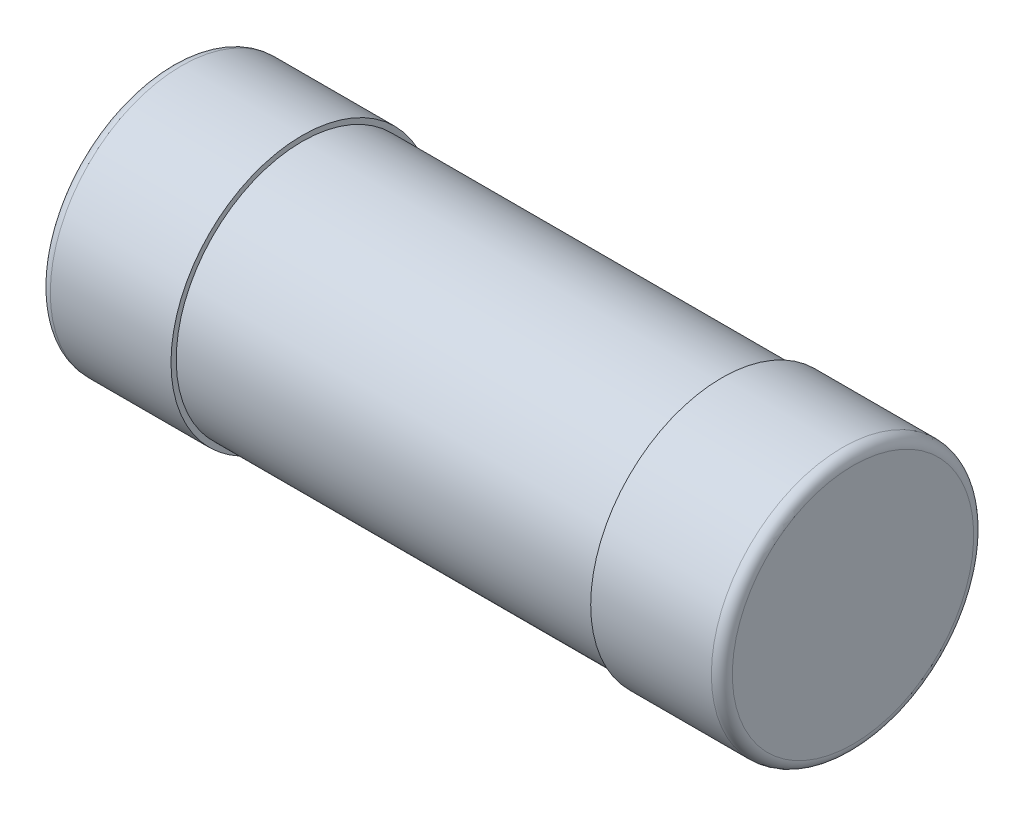
ISO-10303-21;
HEADER;
FILE_DESCRIPTION(('STEP AP214'),'2;1');
FILE_NAME('part.step','',(''),(''),'','','');
FILE_SCHEMA(('AUTOMOTIVE_DESIGN { 1 0 10303 214 1 1 1 1 }'));
ENDSEC;
DATA;
#1=APPLICATION_CONTEXT('core data for automotive mechanical design processes');
#2=APPLICATION_PROTOCOL_DEFINITION('international standard','automotive_design',2000,#1);
#3=PRODUCT_CONTEXT('',#1,'mechanical');
#4=PRODUCT('Part','Part','',(#3));
#5=PRODUCT_RELATED_PRODUCT_CATEGORY('part','',(#4));
#6=PRODUCT_DEFINITION_FORMATION('','',#4);
#7=PRODUCT_DEFINITION_CONTEXT('part definition',#1,'design');
#8=PRODUCT_DEFINITION('design','',#6,#7);
#9=PRODUCT_DEFINITION_SHAPE('','',#8);
#10=(LENGTH_UNIT() NAMED_UNIT(*) SI_UNIT(.MILLI.,.METRE.));
#11=(NAMED_UNIT(*) PLANE_ANGLE_UNIT() SI_UNIT($,.RADIAN.));
#12=(NAMED_UNIT(*) SI_UNIT($,.STERADIAN.) SOLID_ANGLE_UNIT());
#13=UNCERTAINTY_MEASURE_WITH_UNIT(LENGTH_MEASURE(1.E-05),#10,'distance_accuracy_value','');
#14=(GEOMETRIC_REPRESENTATION_CONTEXT(3) GLOBAL_UNCERTAINTY_ASSIGNED_CONTEXT((#13)) GLOBAL_UNIT_ASSIGNED_CONTEXT((#10,
#11,#12)) REPRESENTATION_CONTEXT('',''));
#15=CARTESIAN_POINT('',(0.,0.,0.));
#16=DIRECTION('',(0.,0.,1.));
#17=DIRECTION('',(1.,0.,0.));
#18=AXIS2_PLACEMENT_3D('',#15,#16,#17);
#19=CARTESIAN_POINT('',(3.25,0.,1.25));
#20=DIRECTION('',(1.,0.,0.));
#21=DIRECTION('',(0.,-1.,0.));
#22=AXIS2_PLACEMENT_3D('',#19,#20,#21);
#23=PLANE('',#22);
#24=CARTESIAN_POINT('',(3.25,0.,1.25));
#25=DIRECTION('',(1.,0.,0.));
#26=DIRECTION('',(0.,1.,0.));
#27=AXIS2_PLACEMENT_3D('',#24,#25,#26);
#28=CIRCLE('',#27,1.15);
#29=CARTESIAN_POINT('',(3.25,1.15,1.25));
#30=VERTEX_POINT('',#29);
#31=EDGE_CURVE('E10',#30,#30,#28,.T.);
#32=ORIENTED_EDGE('',*,*,#31,.T.);
#33=EDGE_LOOP('',(#32));
#34=FACE_BOUND('',#33,.T.);
#35=ADVANCED_FACE('F16',(#34),#23,.T.);
#36=CARTESIAN_POINT('',(3.15,0.,1.25));
#37=DIRECTION('',(1.,0.,0.));
#38=DIRECTION('',(0.,1.,0.));
#39=AXIS2_PLACEMENT_3D('',#36,#37,#38);
#40=TOROIDAL_SURFACE('',#39,1.15,0.1);
#41=CARTESIAN_POINT('',(3.15,1.15,1.25));
#42=DIRECTION('',(0.,0.,-1.));
#43=DIRECTION('',(0.,1.,0.));
#44=AXIS2_PLACEMENT_3D('',#41,#42,#43);
#45=CIRCLE('',#44,0.1);
#46=CARTESIAN_POINT('',(3.15,1.25,1.25));
#47=VERTEX_POINT('',#46);
#48=EDGE_CURVE('E26',#47,#30,#45,.T.);
#49=ORIENTED_EDGE('',*,*,#48,.F.);
#50=CARTESIAN_POINT('',(3.15,0.,1.25));
#51=DIRECTION('',(1.,0.,0.));
#52=DIRECTION('',(0.,1.,0.));
#53=AXIS2_PLACEMENT_3D('',#50,#51,#52);
#54=CIRCLE('',#53,1.25);
#55=EDGE_CURVE('E103',#47,#47,#54,.T.);
#56=ORIENTED_EDGE('',*,*,#55,.T.);
#57=ORIENTED_EDGE('',*,*,#48,.T.);
#58=ORIENTED_EDGE('',*,*,#31,.F.);
#59=EDGE_LOOP('',(#49,#56,#57,#58));
#60=FACE_BOUND('',#59,.T.);
#61=ADVANCED_FACE('F127',(#60),#40,.T.);
#62=CARTESIAN_POINT('',(2.,0.,1.25));
#63=DIRECTION('',(-1.,0.,0.));
#64=DIRECTION('',(0.,1.,0.));
#65=AXIS2_PLACEMENT_3D('',#62,#63,#64);
#66=CYLINDRICAL_SURFACE('',#65,1.25);
#67=CARTESIAN_POINT('',(2.,0.,1.25));
#68=DIRECTION('',(1.,0.,0.));
#69=DIRECTION('',(0.,1.,0.));
#70=AXIS2_PLACEMENT_3D('',#67,#68,#69);
#71=CIRCLE('',#70,1.25);
#72=CARTESIAN_POINT('',(2.,1.25,1.25));
#73=VERTEX_POINT('',#72);
#74=EDGE_CURVE('E85',#73,#73,#71,.T.);
#75=ORIENTED_EDGE('',*,*,#74,.T.);
#76=DIRECTION('',(1.,0.,0.));
#77=VECTOR('',#76,1.);
#78=CARTESIAN_POINT('',(2.,1.25,1.25));
#79=LINE('',#78,#77);
#80=EDGE_CURVE('E89',#73,#47,#79,.T.);
#81=ORIENTED_EDGE('',*,*,#80,.T.);
#82=ORIENTED_EDGE('',*,*,#55,.F.);
#83=ORIENTED_EDGE('',*,*,#80,.F.);
#84=EDGE_LOOP('',(#75,#81,#82,#83));
#85=FACE_BOUND('',#84,.T.);
#86=ADVANCED_FACE('F121',(#85),#66,.T.);
#87=CARTESIAN_POINT('',(2.,0.,1.25));
#88=DIRECTION('',(1.,0.,0.));
#89=DIRECTION('',(0.,-1.,0.));
#90=AXIS2_PLACEMENT_3D('',#87,#88,#89);
#91=PLANE('',#90);
#92=CARTESIAN_POINT('',(2.,0.,1.25));
#93=DIRECTION('',(1.,0.,0.));
#94=DIRECTION('',(0.,1.,0.));
#95=AXIS2_PLACEMENT_3D('',#92,#93,#94);
#96=CIRCLE('',#95,1.2);
#97=CARTESIAN_POINT('',(2.,1.2,1.25));
#98=VERTEX_POINT('',#97);
#99=EDGE_CURVE('E96',#98,#98,#96,.T.);
#100=ORIENTED_EDGE('',*,*,#99,.T.);
#101=EDGE_LOOP('',(#100));
#102=FACE_BOUND('',#101,.T.);
#103=ORIENTED_EDGE('',*,*,#74,.F.);
#104=EDGE_LOOP('',(#103));
#105=FACE_BOUND('',#104,.T.);
#106=ADVANCED_FACE('F118',(#102,#105),#91,.F.);
#107=CARTESIAN_POINT('',(-2.,0.,1.25));
#108=DIRECTION('',(-1.,0.,0.));
#109=DIRECTION('',(0.,1.,0.));
#110=AXIS2_PLACEMENT_3D('',#107,#108,#109);
#111=CYLINDRICAL_SURFACE('',#110,1.2);
#112=ORIENTED_EDGE('',*,*,#99,.F.);
#113=DIRECTION('',(1.,0.,0.));
#114=VECTOR('',#113,1.);
#115=CARTESIAN_POINT('',(-2.,1.2,1.25));
#116=LINE('',#115,#114);
#117=CARTESIAN_POINT('',(-2.,1.2,1.25));
#118=VERTEX_POINT('',#117);
#119=EDGE_CURVE('E90',#118,#98,#116,.T.);
#120=ORIENTED_EDGE('',*,*,#119,.F.);
#121=CARTESIAN_POINT('',(-2.,0.,1.25));
#122=DIRECTION('',(1.,0.,0.));
#123=DIRECTION('',(0.,1.,0.));
#124=AXIS2_PLACEMENT_3D('',#121,#122,#123);
#125=CIRCLE('',#124,1.2);
#126=EDGE_CURVE('E82',#118,#118,#125,.T.);
#127=ORIENTED_EDGE('',*,*,#126,.T.);
#128=ORIENTED_EDGE('',*,*,#119,.T.);
#129=EDGE_LOOP('',(#112,#120,#127,#128));
#130=FACE_BOUND('',#129,.T.);
#131=ADVANCED_FACE('F115',(#130),#111,.T.);
#132=CARTESIAN_POINT('',(-3.25,0.,1.25));
#133=DIRECTION('',(-1.,0.,0.));
#134=DIRECTION('',(0.,0.,1.));
#135=AXIS2_PLACEMENT_3D('',#132,#133,#134);
#136=PLANE('',#135);
#137=CARTESIAN_POINT('',(-3.25,0.,1.25));
#138=DIRECTION('',(-1.,0.,0.));
#139=DIRECTION('',(0.,1.,0.));
#140=AXIS2_PLACEMENT_3D('',#137,#138,#139);
#141=CIRCLE('',#140,1.15);
#142=CARTESIAN_POINT('',(-3.25,1.15,1.25));
#143=VERTEX_POINT('',#142);
#144=EDGE_CURVE('E74',#143,#143,#141,.T.);
#145=ORIENTED_EDGE('',*,*,#144,.T.);
#146=EDGE_LOOP('',(#145));
#147=FACE_BOUND('',#146,.T.);
#148=ADVANCED_FACE('F137',(#147),#136,.T.);
#149=CARTESIAN_POINT('',(-2.,0.,1.25));
#150=DIRECTION('',(-1.,0.,0.));
#151=DIRECTION('',(0.,0.,1.));
#152=AXIS2_PLACEMENT_3D('',#149,#150,#151);
#153=PLANE('',#152);
#154=ORIENTED_EDGE('',*,*,#126,.F.);
#155=EDGE_LOOP('',(#154));
#156=FACE_BOUND('',#155,.T.);
#157=CARTESIAN_POINT('',(-2.,0.,1.25));
#158=DIRECTION('',(-1.,0.,0.));
#159=DIRECTION('',(0.,1.,0.));
#160=AXIS2_PLACEMENT_3D('',#157,#158,#159);
#161=CIRCLE('',#160,1.25);
#162=CARTESIAN_POINT('',(-2.,1.25,1.25));
#163=VERTEX_POINT('',#162);
#164=EDGE_CURVE('E19',#163,#163,#161,.T.);
#165=ORIENTED_EDGE('',*,*,#164,.F.);
#166=EDGE_LOOP('',(#165));
#167=FACE_BOUND('',#166,.T.);
#168=ADVANCED_FACE('F141',(#156,#167),#153,.F.);
#169=CARTESIAN_POINT('',(-3.15,0.,1.25));
#170=DIRECTION('',(-1.,0.,0.));
#171=DIRECTION('',(0.,1.,0.));
#172=AXIS2_PLACEMENT_3D('',#169,#170,#171);
#173=TOROIDAL_SURFACE('',#172,1.15,0.1);
#174=CARTESIAN_POINT('',(-3.15,1.15,1.25));
#175=DIRECTION('',(0.,0.,1.));
#176=DIRECTION('',(0.,1.,0.));
#177=AXIS2_PLACEMENT_3D('',#174,#175,#176);
#178=CIRCLE('',#177,0.1);
#179=CARTESIAN_POINT('',(-3.15,1.25,1.25));
#180=VERTEX_POINT('',#179);
#181=EDGE_CURVE('E71',#180,#143,#178,.T.);
#182=ORIENTED_EDGE('',*,*,#181,.F.);
#183=CARTESIAN_POINT('',(-3.15,0.,1.25));
#184=DIRECTION('',(-1.,0.,0.));
#185=DIRECTION('',(0.,1.,0.));
#186=AXIS2_PLACEMENT_3D('',#183,#184,#185);
#187=CIRCLE('',#186,1.25);
#188=EDGE_CURVE('E73',#180,#180,#187,.T.);
#189=ORIENTED_EDGE('',*,*,#188,.T.);
#190=ORIENTED_EDGE('',*,*,#181,.T.);
#191=ORIENTED_EDGE('',*,*,#144,.F.);
#192=EDGE_LOOP('',(#182,#189,#190,#191));
#193=FACE_BOUND('',#192,.T.);
#194=ADVANCED_FACE('F72',(#193),#173,.T.);
#195=CARTESIAN_POINT('',(-2.,0.,1.25));
#196=DIRECTION('',(1.,0.,0.));
#197=DIRECTION('',(0.,1.,0.));
#198=AXIS2_PLACEMENT_3D('',#195,#196,#197);
#199=CYLINDRICAL_SURFACE('',#198,1.25);
#200=ORIENTED_EDGE('',*,*,#164,.T.);
#201=DIRECTION('',(-1.,0.,0.));
#202=VECTOR('',#201,1.);
#203=CARTESIAN_POINT('',(-2.,1.25,1.25));
#204=LINE('',#203,#202);
#205=EDGE_CURVE('E63',#163,#180,#204,.T.);
#206=ORIENTED_EDGE('',*,*,#205,.T.);
#207=ORIENTED_EDGE('',*,*,#188,.F.);
#208=ORIENTED_EDGE('',*,*,#205,.F.);
#209=EDGE_LOOP('',(#200,#206,#207,#208));
#210=FACE_BOUND('',#209,.T.);
#211=ADVANCED_FACE('F152',(#210),#199,.T.);
#212=CLOSED_SHELL('',(#35,#61,#86,#106,#131,#148,#168,#194,#211));
#213=MANIFOLD_SOLID_BREP('B1',#212);
#214=ADVANCED_BREP_SHAPE_REPRESENTATION('',(#18,#213),#14);
#215=SHAPE_DEFINITION_REPRESENTATION(#9,#214);
ENDSEC;
END-ISO-10303-21;
